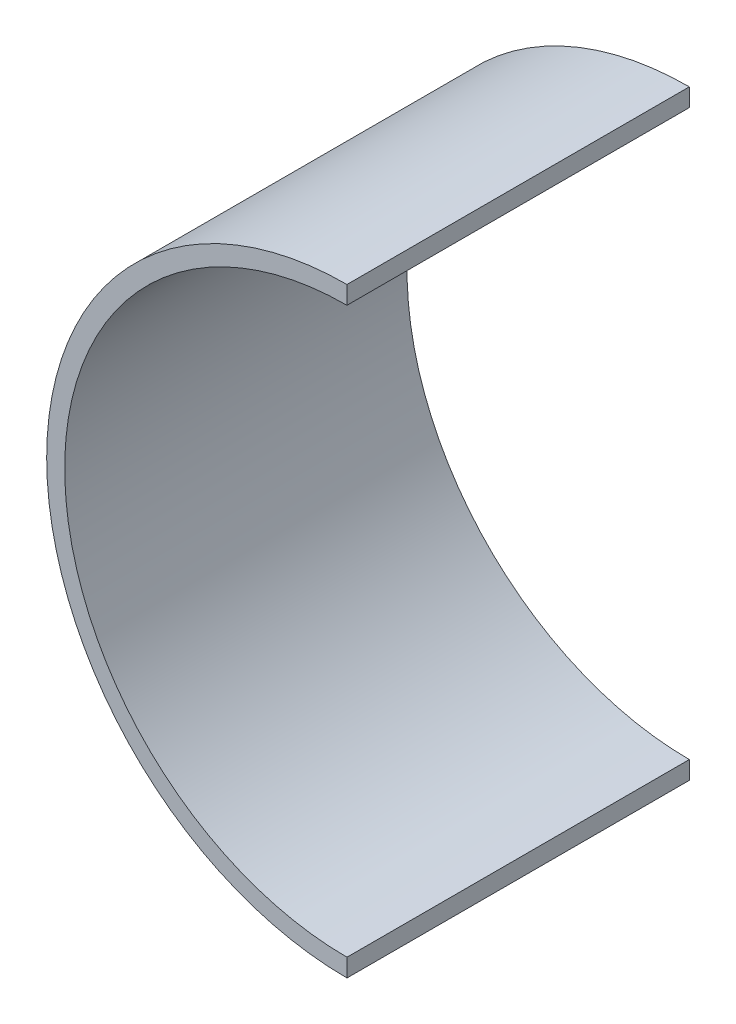
ISO-10303-21;
HEADER;
FILE_DESCRIPTION(('STEP AP214'),'2;1');
FILE_NAME('part.step','',(''),(''),'','','');
FILE_SCHEMA(('AUTOMOTIVE_DESIGN { 1 0 10303 214 1 1 1 1 }'));
ENDSEC;
DATA;
#1=APPLICATION_CONTEXT('core data for automotive mechanical design processes');
#2=APPLICATION_PROTOCOL_DEFINITION('international standard','automotive_design',2000,#1);
#3=PRODUCT_CONTEXT('',#1,'mechanical');
#4=PRODUCT('Part','Part','',(#3));
#5=PRODUCT_RELATED_PRODUCT_CATEGORY('part','',(#4));
#6=PRODUCT_DEFINITION_FORMATION('','',#4);
#7=PRODUCT_DEFINITION_CONTEXT('part definition',#1,'design');
#8=PRODUCT_DEFINITION('design','',#6,#7);
#9=PRODUCT_DEFINITION_SHAPE('','',#8);
#10=(LENGTH_UNIT() NAMED_UNIT(*) SI_UNIT(.MILLI.,.METRE.));
#11=(NAMED_UNIT(*) PLANE_ANGLE_UNIT() SI_UNIT($,.RADIAN.));
#12=(NAMED_UNIT(*) SI_UNIT($,.STERADIAN.) SOLID_ANGLE_UNIT());
#13=UNCERTAINTY_MEASURE_WITH_UNIT(LENGTH_MEASURE(1.E-05),#10,'distance_accuracy_value','');
#14=(GEOMETRIC_REPRESENTATION_CONTEXT(3) GLOBAL_UNCERTAINTY_ASSIGNED_CONTEXT((#13)) GLOBAL_UNIT_ASSIGNED_CONTEXT((#10,
#11,#12)) REPRESENTATION_CONTEXT('',''));
#15=CARTESIAN_POINT('',(0.,0.,0.));
#16=DIRECTION('',(0.,0.,1.));
#17=DIRECTION('',(1.,0.,0.));
#18=AXIS2_PLACEMENT_3D('',#15,#16,#17);
#19=CARTESIAN_POINT('',(-300.,0.,0.));
#20=DIRECTION('',(-1.,0.,0.));
#21=DIRECTION('',(0.,0.,1.));
#22=AXIS2_PLACEMENT_3D('',#19,#20,#21);
#23=PLANE('',#22);
#24=DIRECTION('',(0.,0.,1.));
#25=VECTOR('',#24,1.);
#26=CARTESIAN_POINT('',(-300.,47.,3.));
#27=LINE('',#26,#25);
#28=CARTESIAN_POINT('',(-300.,47.,3.));
#29=VERTEX_POINT('',#28);
#30=CARTESIAN_POINT('',(-300.,47.,60.));
#31=VERTEX_POINT('',#30);
#32=EDGE_CURVE('E93',#29,#31,#27,.T.);
#33=ORIENTED_EDGE('',*,*,#32,.F.);
#34=DIRECTION('',(0.,1.,0.));
#35=VECTOR('',#34,1.);
#36=CARTESIAN_POINT('',(-300.,0.,3.));
#37=LINE('',#36,#35);
#38=CARTESIAN_POINT('',(-300.,50.,3.));
#39=VERTEX_POINT('',#38);
#40=EDGE_CURVE('E11',#29,#39,#37,.T.);
#41=ORIENTED_EDGE('',*,*,#40,.T.);
#42=DIRECTION('',(0.,0.,-1.));
#43=VECTOR('',#42,1.);
#44=CARTESIAN_POINT('',(-300.,50.,60.));
#45=LINE('',#44,#43);
#46=CARTESIAN_POINT('',(-300.,50.,60.));
#47=VERTEX_POINT('',#46);
#48=EDGE_CURVE('E94',#47,#39,#45,.T.);
#49=ORIENTED_EDGE('',*,*,#48,.F.);
#50=DIRECTION('',(0.,-1.,0.));
#51=VECTOR('',#50,1.);
#52=CARTESIAN_POINT('',(-300.,0.,60.));
#53=LINE('',#52,#51);
#54=EDGE_CURVE('E88',#47,#31,#53,.T.);
#55=ORIENTED_EDGE('',*,*,#54,.T.);
#56=EDGE_LOOP('',(#33,#41,#49,#55));
#57=FACE_BOUND('',#56,.T.);
#58=ADVANCED_FACE('F32',(#57),#23,.F.);
#59=CARTESIAN_POINT('',(-300.,0.,60.));
#60=DIRECTION('',(0.,0.,1.));
#61=DIRECTION('',(1.,0.,0.));
#62=AXIS2_PLACEMENT_3D('',#59,#60,#61);
#63=PLANE('',#62);
#64=ORIENTED_EDGE('',*,*,#54,.F.);
#65=CARTESIAN_POINT('',(-300.,0.,60.));
#66=DIRECTION('',(0.,0.,1.));
#67=DIRECTION('',(1.,0.,0.));
#68=AXIS2_PLACEMENT_3D('',#65,#66,#67);
#69=CIRCLE('',#68,50.);
#70=CARTESIAN_POINT('',(-300.,-50.,60.));
#71=VERTEX_POINT('',#70);
#72=EDGE_CURVE('E76',#47,#71,#69,.T.);
#73=ORIENTED_EDGE('',*,*,#72,.T.);
#74=CARTESIAN_POINT('',(-300.,-47.,60.));
#75=VERTEX_POINT('',#74);
#76=EDGE_CURVE('E80',#75,#71,#53,.T.);
#77=ORIENTED_EDGE('',*,*,#76,.F.);
#78=CARTESIAN_POINT('',(-300.,0.,60.));
#79=DIRECTION('',(0.,0.,1.));
#80=DIRECTION('',(1.,0.,0.));
#81=AXIS2_PLACEMENT_3D('',#78,#79,#80);
#82=CIRCLE('',#81,47.);
#83=EDGE_CURVE('E96',#31,#75,#82,.T.);
#84=ORIENTED_EDGE('',*,*,#83,.F.);
#85=EDGE_LOOP('',(#64,#73,#77,#84));
#86=FACE_BOUND('',#85,.T.);
#87=ADVANCED_FACE('F91',(#86),#63,.T.);
#88=CARTESIAN_POINT('',(0.,0.,3.));
#89=DIRECTION('',(0.,0.,1.));
#90=DIRECTION('',(1.,0.,0.));
#91=AXIS2_PLACEMENT_3D('',#88,#89,#90);
#92=PLANE('',#91);
#93=DIRECTION('',(0.,1.,0.));
#94=VECTOR('',#93,1.);
#95=CARTESIAN_POINT('',(-300.,0.,3.));
#96=LINE('',#95,#94);
#97=CARTESIAN_POINT('',(-300.,-50.,3.));
#98=VERTEX_POINT('',#97);
#99=CARTESIAN_POINT('',(-300.,-47.,3.));
#100=VERTEX_POINT('',#99);
#101=EDGE_CURVE('E41',#98,#100,#96,.T.);
#102=ORIENTED_EDGE('',*,*,#101,.F.);
#103=CARTESIAN_POINT('',(-300.,0.,3.));
#104=DIRECTION('',(0.,0.,1.));
#105=DIRECTION('',(1.,0.,0.));
#106=AXIS2_PLACEMENT_3D('',#103,#104,#105);
#107=CIRCLE('',#106,50.);
#108=EDGE_CURVE('E78',#39,#98,#107,.T.);
#109=ORIENTED_EDGE('',*,*,#108,.F.);
#110=ORIENTED_EDGE('',*,*,#40,.F.);
#111=CARTESIAN_POINT('',(-300.,0.,3.));
#112=DIRECTION('',(0.,0.,1.));
#113=DIRECTION('',(1.,0.,0.));
#114=AXIS2_PLACEMENT_3D('',#111,#112,#113);
#115=CIRCLE('',#114,47.);
#116=EDGE_CURVE('E36',#100,#29,#115,.F.);
#117=ORIENTED_EDGE('',*,*,#116,.F.);
#118=EDGE_LOOP('',(#102,#109,#110,#117));
#119=FACE_BOUND('',#118,.T.);
#120=ADVANCED_FACE('F34',(#119),#92,.F.);
#121=CARTESIAN_POINT('',(-300.,0.,3.));
#122=DIRECTION('',(0.,0.,1.));
#123=DIRECTION('',(1.,0.,0.));
#124=AXIS2_PLACEMENT_3D('',#121,#122,#123);
#125=CYLINDRICAL_SURFACE('',#124,47.);
#126=DIRECTION('',(0.,0.,1.));
#127=VECTOR('',#126,1.);
#128=CARTESIAN_POINT('',(-300.,-47.,3.));
#129=LINE('',#128,#127);
#130=EDGE_CURVE('E81',#100,#75,#129,.T.);
#131=ORIENTED_EDGE('',*,*,#130,.F.);
#132=ORIENTED_EDGE('',*,*,#116,.T.);
#133=ORIENTED_EDGE('',*,*,#32,.T.);
#134=ORIENTED_EDGE('',*,*,#83,.T.);
#135=EDGE_LOOP('',(#131,#132,#133,#134));
#136=FACE_BOUND('',#135,.T.);
#137=ADVANCED_FACE('F103',(#136),#125,.F.);
#138=CARTESIAN_POINT('',(-300.,0.,60.));
#139=DIRECTION('',(0.,0.,-1.));
#140=DIRECTION('',(-1.,0.,0.));
#141=AXIS2_PLACEMENT_3D('',#138,#139,#140);
#142=CYLINDRICAL_SURFACE('',#141,50.);
#143=ORIENTED_EDGE('',*,*,#48,.T.);
#144=ORIENTED_EDGE('',*,*,#108,.T.);
#145=DIRECTION('',(0.,0.,-1.));
#146=VECTOR('',#145,1.);
#147=CARTESIAN_POINT('',(-300.,-50.,60.));
#148=LINE('',#147,#146);
#149=EDGE_CURVE('E71',#71,#98,#148,.T.);
#150=ORIENTED_EDGE('',*,*,#149,.F.);
#151=ORIENTED_EDGE('',*,*,#72,.F.);
#152=EDGE_LOOP('',(#143,#144,#150,#151));
#153=FACE_BOUND('',#152,.T.);
#154=ADVANCED_FACE('F74',(#153),#142,.T.);
#155=ORIENTED_EDGE('',*,*,#149,.T.);
#156=ORIENTED_EDGE('',*,*,#101,.T.);
#157=ORIENTED_EDGE('',*,*,#130,.T.);
#158=ORIENTED_EDGE('',*,*,#76,.T.);
#159=EDGE_LOOP('',(#155,#156,#157,#158));
#160=FACE_BOUND('',#159,.T.);
#161=ADVANCED_FACE('F84',(#160),#23,.F.);
#162=CLOSED_SHELL('',(#58,#87,#120,#137,#154,#161));
#163=MANIFOLD_SOLID_BREP('B2',#162);
#164=ADVANCED_BREP_SHAPE_REPRESENTATION('',(#18,#163),#14);
#165=SHAPE_DEFINITION_REPRESENTATION(#9,#164);
ENDSEC;
END-ISO-10303-21;
